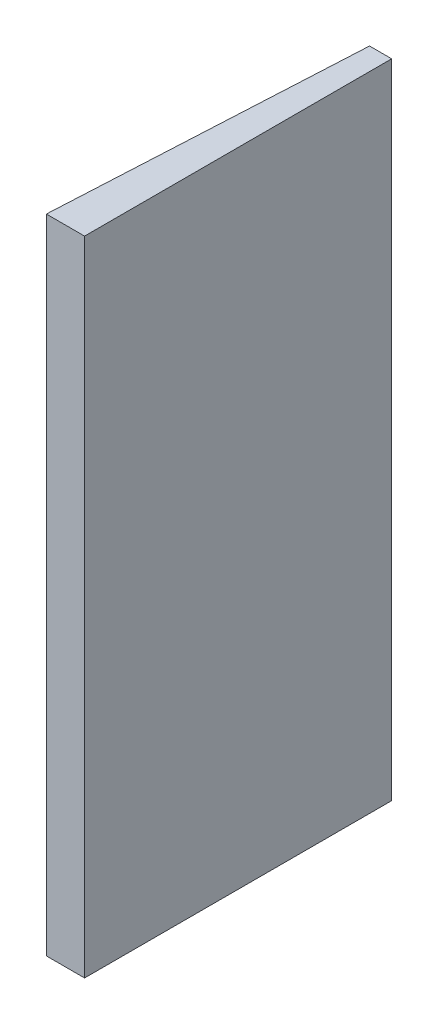
ISO-10303-21;
HEADER;
FILE_DESCRIPTION(('STEP AP214'),'2;1');
FILE_NAME('part.step','',(''),(''),'','','');
FILE_SCHEMA(('AUTOMOTIVE_DESIGN { 1 0 10303 214 1 1 1 1 }'));
ENDSEC;
DATA;
#1=APPLICATION_CONTEXT('core data for automotive mechanical design processes');
#2=APPLICATION_PROTOCOL_DEFINITION('international standard','automotive_design',2000,#1);
#3=PRODUCT_CONTEXT('',#1,'mechanical');
#4=PRODUCT('Part','Part','',(#3));
#5=PRODUCT_RELATED_PRODUCT_CATEGORY('part','',(#4));
#6=PRODUCT_DEFINITION_FORMATION('','',#4);
#7=PRODUCT_DEFINITION_CONTEXT('part definition',#1,'design');
#8=PRODUCT_DEFINITION('design','',#6,#7);
#9=PRODUCT_DEFINITION_SHAPE('','',#8);
#10=(LENGTH_UNIT() NAMED_UNIT(*) SI_UNIT(.MILLI.,.METRE.));
#11=(NAMED_UNIT(*) PLANE_ANGLE_UNIT() SI_UNIT($,.RADIAN.));
#12=(NAMED_UNIT(*) SI_UNIT($,.STERADIAN.) SOLID_ANGLE_UNIT());
#13=UNCERTAINTY_MEASURE_WITH_UNIT(LENGTH_MEASURE(1.E-05),#10,'distance_accuracy_value','');
#14=(GEOMETRIC_REPRESENTATION_CONTEXT(3) GLOBAL_UNCERTAINTY_ASSIGNED_CONTEXT((#13)) GLOBAL_UNIT_ASSIGNED_CONTEXT((#10,
#11,#12)) REPRESENTATION_CONTEXT('',''));
#15=CARTESIAN_POINT('',(0.,0.,0.));
#16=DIRECTION('',(0.,0.,1.));
#17=DIRECTION('',(1.,0.,0.));
#18=AXIS2_PLACEMENT_3D('',#15,#16,#17);
#19=CARTESIAN_POINT('',(-2.89582766178603,42.,-20.0576731421159));
#20=DIRECTION('',(0.,0.,1.));
#21=DIRECTION('',(1.,0.,0.));
#22=AXIS2_PLACEMENT_3D('',#19,#20,#21);
#23=PLANE('',#22);
#24=DIRECTION('',(-1.,0.,0.));
#25=VECTOR('',#24,1.);
#26=CARTESIAN_POINT('',(-2.89582766178603,-42.,-20.0576731421159));
#27=LINE('',#26,#25);
#28=CARTESIAN_POINT('',(0.,-42.,-20.0576731421159));
#29=VERTEX_POINT('',#28);
#30=CARTESIAN_POINT('',(-2.89582766178603,-42.,-20.0576731421159));
#31=VERTEX_POINT('',#30);
#32=EDGE_CURVE('E106',#29,#31,#27,.T.);
#33=ORIENTED_EDGE('',*,*,#32,.T.);
#34=DIRECTION('',(0.,-1.,0.));
#35=VECTOR('',#34,1.);
#36=CARTESIAN_POINT('',(-2.89582766178603,42.,-20.0576731421159));
#37=LINE('',#36,#35);
#38=CARTESIAN_POINT('',(-2.89582766178603,42.,-20.0576731421159));
#39=VERTEX_POINT('',#38);
#40=EDGE_CURVE('E12',#39,#31,#37,.T.);
#41=ORIENTED_EDGE('',*,*,#40,.F.);
#42=DIRECTION('',(-1.,0.,0.));
#43=VECTOR('',#42,1.);
#44=CARTESIAN_POINT('',(-2.89582766178603,42.,-20.0576731421159));
#45=LINE('',#44,#43);
#46=CARTESIAN_POINT('',(0.,42.,-20.0576731421159));
#47=VERTEX_POINT('',#46);
#48=EDGE_CURVE('E94',#47,#39,#45,.T.);
#49=ORIENTED_EDGE('',*,*,#48,.F.);
#50=DIRECTION('',(0.,-1.,0.));
#51=VECTOR('',#50,1.);
#52=CARTESIAN_POINT('',(0.,42.,-20.0576731421159));
#53=LINE('',#52,#51);
#54=EDGE_CURVE('E102',#47,#29,#53,.T.);
#55=ORIENTED_EDGE('',*,*,#54,.T.);
#56=EDGE_LOOP('',(#33,#41,#49,#55));
#57=FACE_BOUND('',#56,.T.);
#58=ADVANCED_FACE('F43',(#57),#23,.F.);
#59=CARTESIAN_POINT('',(-4.99999999999999,42.,20.0923268578841));
#60=DIRECTION('',(0.998629534754574,0.,0.0523359562429404));
#61=DIRECTION('',(0.0523359562429404,0.,-0.998629534754574));
#62=AXIS2_PLACEMENT_3D('',#59,#60,#61);
#63=PLANE('',#62);
#64=CARTESIAN_POINT('',(-3.69421789173863,29.8956518577535,-4.82348003424252));
#65=DIRECTION('',(-0.998629534754574,0.,-0.0523359562429404));
#66=DIRECTION('',(-0.0523359562429404,0.,0.998629534754574));
#67=AXIS2_PLACEMENT_3D('',#64,#65,#66);
#68=CIRCLE('',#67,6.3);
#69=CARTESIAN_POINT('',(-4.02393441606916,29.8956518577535,1.4678860347113));
#70=VERTEX_POINT('',#69);
#71=EDGE_CURVE('E127',#70,#70,#68,.T.);
#72=ORIENTED_EDGE('',*,*,#71,.F.);
#73=EDGE_LOOP('',(#72));
#74=FACE_BOUND('',#73,.T.);
#75=CARTESIAN_POINT('',(-3.69421789173863,-29.8956518577535,-4.82348003424252));
#76=DIRECTION('',(-0.998629534754574,0.,-0.0523359562429404));
#77=DIRECTION('',(-0.0523359562429404,0.,0.998629534754574));
#78=AXIS2_PLACEMENT_3D('',#75,#76,#77);
#79=CIRCLE('',#78,6.3);
#80=CARTESIAN_POINT('',(-3.87402597815768,-24.6149036705919,-1.39253735972165));
#81=VERTEX_POINT('',#80);
#82=EDGE_CURVE('E109',#81,#81,#79,.T.);
#83=ORIENTED_EDGE('',*,*,#82,.F.);
#84=EDGE_LOOP('',(#83));
#85=FACE_BOUND('',#84,.T.);
#86=DIRECTION('',(-0.0523359562429404,0.,0.998629534754574));
#87=VECTOR('',#86,1.);
#88=CARTESIAN_POINT('',(-4.99999999999999,-42.,20.0923268578841));
#89=LINE('',#88,#87);
#90=CARTESIAN_POINT('',(-4.99999999999999,-42.,20.0923268578841));
#91=VERTEX_POINT('',#90);
#92=EDGE_CURVE('E98',#31,#91,#89,.T.);
#93=ORIENTED_EDGE('',*,*,#92,.T.);
#94=DIRECTION('',(0.,-1.,0.));
#95=VECTOR('',#94,1.);
#96=CARTESIAN_POINT('',(-4.99999999999999,42.,20.0923268578841));
#97=LINE('',#96,#95);
#98=CARTESIAN_POINT('',(-4.99999999999999,42.,20.0923268578841));
#99=VERTEX_POINT('',#98);
#100=EDGE_CURVE('E51',#99,#91,#97,.T.);
#101=ORIENTED_EDGE('',*,*,#100,.F.);
#102=DIRECTION('',(-0.0523359562429404,0.,0.998629534754574));
#103=VECTOR('',#102,1.);
#104=CARTESIAN_POINT('',(-4.99999999999999,42.,20.0923268578841));
#105=LINE('',#104,#103);
#106=EDGE_CURVE('E89',#39,#99,#105,.T.);
#107=ORIENTED_EDGE('',*,*,#106,.F.);
#108=ORIENTED_EDGE('',*,*,#40,.T.);
#109=EDGE_LOOP('',(#93,#101,#107,#108));
#110=FACE_BOUND('',#109,.T.);
#111=ADVANCED_FACE('F97',(#74,#85,#110),#63,.F.);
#112=CARTESIAN_POINT('',(0.,42.,20.0923268578841));
#113=DIRECTION('',(0.,0.,-1.));
#114=DIRECTION('',(-1.,0.,0.));
#115=AXIS2_PLACEMENT_3D('',#112,#113,#114);
#116=PLANE('',#115);
#117=DIRECTION('',(1.,0.,0.));
#118=VECTOR('',#117,1.);
#119=CARTESIAN_POINT('',(0.,-42.,20.0923268578841));
#120=LINE('',#119,#118);
#121=CARTESIAN_POINT('',(0.,-42.,20.0923268578841));
#122=VERTEX_POINT('',#121);
#123=EDGE_CURVE('E76',#91,#122,#120,.T.);
#124=ORIENTED_EDGE('',*,*,#123,.T.);
#125=DIRECTION('',(0.,-1.,0.));
#126=VECTOR('',#125,1.);
#127=CARTESIAN_POINT('',(0.,42.,20.0923268578841));
#128=LINE('',#127,#126);
#129=CARTESIAN_POINT('',(0.,42.,20.0923268578841));
#130=VERTEX_POINT('',#129);
#131=EDGE_CURVE('E99',#130,#122,#128,.T.);
#132=ORIENTED_EDGE('',*,*,#131,.F.);
#133=DIRECTION('',(1.,0.,0.));
#134=VECTOR('',#133,1.);
#135=CARTESIAN_POINT('',(0.,42.,20.0923268578841));
#136=LINE('',#135,#134);
#137=EDGE_CURVE('E92',#99,#130,#136,.T.);
#138=ORIENTED_EDGE('',*,*,#137,.F.);
#139=ORIENTED_EDGE('',*,*,#100,.T.);
#140=EDGE_LOOP('',(#124,#132,#138,#139));
#141=FACE_BOUND('',#140,.T.);
#142=ADVANCED_FACE('F100',(#141),#116,.F.);
#143=CARTESIAN_POINT('',(0.,42.,-20.0576731421159));
#144=DIRECTION('',(-1.,0.,0.));
#145=DIRECTION('',(0.,0.,1.));
#146=AXIS2_PLACEMENT_3D('',#143,#144,#145);
#147=PLANE('',#146);
#148=DIRECTION('',(0.,0.,-1.));
#149=VECTOR('',#148,1.);
#150=CARTESIAN_POINT('',(0.,-42.,-20.0576731421159));
#151=LINE('',#150,#149);
#152=EDGE_CURVE('E82',#122,#29,#151,.T.);
#153=ORIENTED_EDGE('',*,*,#152,.T.);
#154=ORIENTED_EDGE('',*,*,#54,.F.);
#155=DIRECTION('',(0.,0.,-1.));
#156=VECTOR('',#155,1.);
#157=CARTESIAN_POINT('',(0.,42.,-20.0576731421159));
#158=LINE('',#157,#156);
#159=EDGE_CURVE('E59',#130,#47,#158,.T.);
#160=ORIENTED_EDGE('',*,*,#159,.F.);
#161=ORIENTED_EDGE('',*,*,#131,.T.);
#162=EDGE_LOOP('',(#153,#154,#160,#161));
#163=FACE_BOUND('',#162,.T.);
#164=ADVANCED_FACE('F114',(#163),#147,.F.);
#165=CARTESIAN_POINT('',(0.,42.,0.));
#166=DIRECTION('',(0.,-1.,0.));
#167=DIRECTION('',(0.,0.,-1.));
#168=AXIS2_PLACEMENT_3D('',#165,#166,#167);
#169=PLANE('',#168);
#170=ORIENTED_EDGE('',*,*,#48,.T.);
#171=ORIENTED_EDGE('',*,*,#106,.T.);
#172=ORIENTED_EDGE('',*,*,#137,.T.);
#173=ORIENTED_EDGE('',*,*,#159,.T.);
#174=EDGE_LOOP('',(#170,#171,#172,#173));
#175=FACE_BOUND('',#174,.T.);
#176=ADVANCED_FACE('F90',(#175),#169,.F.);
#177=CARTESIAN_POINT('',(0.,-42.,0.));
#178=DIRECTION('',(0.,-1.,0.));
#179=DIRECTION('',(0.,0.,-1.));
#180=AXIS2_PLACEMENT_3D('',#177,#178,#179);
#181=PLANE('',#180);
#182=ORIENTED_EDGE('',*,*,#32,.F.);
#183=ORIENTED_EDGE('',*,*,#152,.F.);
#184=ORIENTED_EDGE('',*,*,#123,.F.);
#185=ORIENTED_EDGE('',*,*,#92,.F.);
#186=EDGE_LOOP('',(#182,#183,#184,#185));
#187=FACE_BOUND('',#186,.T.);
#188=ADVANCED_FACE('F117',(#187),#181,.T.);
#189=CARTESIAN_POINT('',(-6.69010649600236,-29.8956518577535,-4.98048790297134));
#190=DIRECTION('',(-0.998629534754574,0.,-0.0523359562429404));
#191=DIRECTION('',(-0.0523359562429404,0.,0.998629534754574));
#192=AXIS2_PLACEMENT_3D('',#189,#190,#191);
#193=PLANE('',#192);
#194=CARTESIAN_POINT('',(-6.69010649600236,-29.8956518577535,-4.98048790297134));
#195=DIRECTION('',(-0.998629534754574,0.,-0.0523359562429404));
#196=DIRECTION('',(-0.0523359562429404,0.,0.998629534754574));
#197=AXIS2_PLACEMENT_3D('',#194,#195,#196);
#198=CIRCLE('',#197,3.3);
#199=CARTESIAN_POINT('',(-6.74491919075224,-26.7662569049443,-3.93459938222608));
#200=VERTEX_POINT('',#199);
#201=EDGE_CURVE('E122',#200,#200,#198,.T.);
#202=ORIENTED_EDGE('',*,*,#201,.T.);
#203=EDGE_LOOP('',(#202));
#204=FACE_BOUND('',#203,.T.);
#205=ADVANCED_FACE('F133',(#204),#193,.T.);
#206=CARTESIAN_POINT('',(-6.74491919075224,-26.7662569049443,-3.93459938222608));
#207=CARTESIAN_POINT('',(-3.87402597815768,-24.6149036705919,-1.39253735972165));
#208=CARTESIAN_POINT('',(-7.07247894538644,-28.8609045882863,2.3156130693482));
#209=CARTESIAN_POINT('',(-4.42677199026422,-31.4862059005306,9.15448485088072));
#210=CARTESIAN_POINT('',(-6.96285355588668,-35.1196944939046,0.223836027857672));
#211=CARTESIAN_POINT('',(-4.06715581742613,-42.0477022748537,2.29259950183898));
#212=CARTESIAN_POINT('',(-6.63529380125248,-33.0250468105627,-6.02637642371661));
#213=CARTESIAN_POINT('',(-3.51440980531959,-35.176400044915,-8.25442270876339));
#214=CARTESIAN_POINT('',(-6.30773404661828,-30.9303991272207,-12.2765888752909));
#215=CARTESIAN_POINT('',(-2.96166379321304,-28.3050978149763,-18.8014449193658));
#216=CARTESIAN_POINT('',(-6.41735943611804,-24.6716092216023,-10.1848118338004));
#217=CARTESIAN_POINT('',(-3.32127996605113,-17.7436014406532,-11.939559570324));
#218=CARTESIAN_POINT('',(-6.74491919075224,-26.7662569049443,-3.93459938222608));
#219=CARTESIAN_POINT('',(-3.87402597815768,-24.6149036705919,-1.39253735972165));
#220=(BOUNDED_SURFACE() B_SPLINE_SURFACE(3,1,((#206,#207),(#208,#209),(#210,#211),(#212,#213),
(#214,#215),(#216,#217),(#218,#219)),.UNSPECIFIED.,.T.,.F.,.F.) B_SPLINE_SURFACE_WITH_KNOTS((4,
3,4),(2,2),(0.,0.5,1.),(0.,1.),
.UNSPECIFIED.) GEOMETRIC_REPRESENTATION_ITEM() RATIONAL_B_SPLINE_SURFACE(((1.,1.),
(0.333333333333333,0.333333333333333),(0.333333333333333,0.333333333333333),(1.,1.),
(0.333333333333333,0.333333333333333),(0.333333333333333,0.333333333333333),(1.,1.))) REPRESENTATION_ITEM('') SURFACE());
#221=CARTESIAN_POINT('',(-6.74491919075224,-26.7662569049443,-3.93459938222608));
#222=CARTESIAN_POINT('',(-6.71501405312104,-26.7438469754198,-3.90811956949166));
#223=CARTESIAN_POINT('',(-6.68510891548985,-26.7214370458953,-3.88163975675724));
#224=CARTESIAN_POINT('',(-6.62529864022746,-26.6766171868463,-3.82868013128839));
#225=CARTESIAN_POINT('',(-6.59539350259627,-26.6542072573218,-3.80220031855397));
#226=CARTESIAN_POINT('',(-6.53558322733389,-26.6093873982728,-3.74924069308513));
#227=CARTESIAN_POINT('',(-6.50567808970269,-26.5869774687483,-3.72276088035071));
#228=CARTESIAN_POINT('',(-6.44586781444031,-26.5421576096993,-3.66980125488187));
#229=CARTESIAN_POINT('',(-6.41596267680911,-26.5197476801748,-3.64332144214745));
#230=CARTESIAN_POINT('',(-6.35615240154673,-26.4749278211258,-3.5903618166786));
#231=CARTESIAN_POINT('',(-6.32624726391553,-26.4525178916013,-3.56388200394418));
#232=CARTESIAN_POINT('',(-6.26643698865314,-26.4076980325522,-3.51092237847534));
#233=CARTESIAN_POINT('',(-6.23653185102195,-26.3852881030277,-3.48444256574092));
#234=CARTESIAN_POINT('',(-6.17672157575957,-26.3404682439787,-3.43148294027208));
#235=CARTESIAN_POINT('',(-6.14681643812837,-26.3180583144542,-3.40500312753766));
#236=CARTESIAN_POINT('',(-6.08700616286598,-26.2732384554052,-3.35204350206881));
#237=CARTESIAN_POINT('',(-6.05710102523479,-26.2508285258807,-3.32556368933439));
#238=CARTESIAN_POINT('',(-5.9972907499724,-26.2060086668317,-3.27260406386555));
#239=CARTESIAN_POINT('',(-5.96738561234121,-26.1835987373072,-3.24612425113113));
#240=CARTESIAN_POINT('',(-5.90757533707882,-26.1387788782582,-3.19316462566229));
#241=CARTESIAN_POINT('',(-5.87767019944763,-26.1163689487337,-3.16668481292787));
#242=CARTESIAN_POINT('',(-5.81785992418525,-26.0715490896847,-3.11372518745902));
#243=CARTESIAN_POINT('',(-5.78795478655405,-26.0491391601602,-3.0872453747246));
#244=CARTESIAN_POINT('',(-5.72814451129166,-26.0043193011112,-3.03428574925576));
#245=CARTESIAN_POINT('',(-5.69823937366047,-25.9819093715867,-3.00780593652134));
#246=CARTESIAN_POINT('',(-5.63842909839809,-25.9370895125377,-2.9548463110525));
#247=CARTESIAN_POINT('',(-5.60852396076689,-25.9146795830132,-2.92836649831808));
#248=CARTESIAN_POINT('',(-5.5487136855045,-25.8698597239642,-2.87540687284923));
#249=CARTESIAN_POINT('',(-5.51880854787331,-25.8474497944397,-2.84892706011481));
#250=CARTESIAN_POINT('',(-5.45899827261093,-25.8026299353906,-2.79596743464597));
#251=CARTESIAN_POINT('',(-5.42909313497973,-25.7802200058661,-2.76948762191155));
#252=CARTESIAN_POINT('',(-5.36928285971734,-25.7354001468171,-2.71652799644271));
#253=CARTESIAN_POINT('',(-5.33937772208615,-25.7129902172926,-2.69004818370829));
#254=CARTESIAN_POINT('',(-5.27956744682376,-25.6681703582436,-2.63708855823944));
#255=CARTESIAN_POINT('',(-5.24966230919257,-25.6457604287191,-2.61060874550502));
#256=CARTESIAN_POINT('',(-5.18985203393019,-25.6009405696701,-2.55764912003618));
#257=CARTESIAN_POINT('',(-5.15994689629899,-25.5785306401456,-2.53116930730176));
#258=CARTESIAN_POINT('',(-5.1001366210366,-25.5337107810966,-2.47820968183292));
#259=CARTESIAN_POINT('',(-5.07023148340541,-25.5113008515721,-2.4517298690985));
#260=CARTESIAN_POINT('',(-5.01042120814302,-25.4664809925231,-2.39877024362965));
#261=CARTESIAN_POINT('',(-4.98051607051183,-25.4440710629986,-2.37229043089523));
#262=CARTESIAN_POINT('',(-4.92070579524944,-25.3992512039496,-2.31933080542639));
#263=CARTESIAN_POINT('',(-4.89080065761825,-25.3768412744251,-2.29285099269197));
#264=CARTESIAN_POINT('',(-4.83099038235586,-25.3320214153761,-2.23989136722313));
#265=CARTESIAN_POINT('',(-4.80108524472467,-25.3096114858516,-2.21341155448871));
#266=CARTESIAN_POINT('',(-4.74127496946229,-25.2647916268026,-2.16045192901986));
#267=CARTESIAN_POINT('',(-4.71136983183109,-25.242381697278,-2.13397211628544));
#268=CARTESIAN_POINT('',(-4.6515595565687,-25.197561838229,-2.0810124908166));
#269=CARTESIAN_POINT('',(-4.62165441893751,-25.1751519087045,-2.05453267808218));
#270=CARTESIAN_POINT('',(-4.56184414367512,-25.1303320496555,-2.00157305261334));
#271=CARTESIAN_POINT('',(-4.53193900604393,-25.107922120131,-1.97509323987892));
#272=CARTESIAN_POINT('',(-4.47212873078155,-25.063102261082,-1.92213361441007));
#273=CARTESIAN_POINT('',(-4.44222359315035,-25.0406923315575,-1.89565380167565));
#274=CARTESIAN_POINT('',(-4.38241331788796,-24.9958724725085,-1.84269417620681));
#275=CARTESIAN_POINT('',(-4.35250818025677,-24.973462542984,-1.81621436347239));
#276=CARTESIAN_POINT('',(-4.29269790499438,-24.928642683935,-1.76325473800355));
#277=CARTESIAN_POINT('',(-4.26279276736319,-24.9062327544105,-1.73677492526913));
#278=CARTESIAN_POINT('',(-4.2029824921008,-24.8614128953615,-1.68381529980028));
#279=CARTESIAN_POINT('',(-4.17307735446961,-24.839002965837,-1.65733548706586));
#280=CARTESIAN_POINT('',(-4.11326707920722,-24.794183106788,-1.60437586159702));
#281=CARTESIAN_POINT('',(-4.08336194157603,-24.7717731772635,-1.5778960488626));
#282=CARTESIAN_POINT('',(-4.02355166631365,-24.7269533182145,-1.52493642339376));
#283=CARTESIAN_POINT('',(-3.99364652868245,-24.70454338869,-1.49845661065934));
#284=CARTESIAN_POINT('',(-3.93383625342006,-24.6597235296409,-1.44549698519049));
#285=CARTESIAN_POINT('',(-3.90393111578887,-24.6373136001164,-1.41901717245607));
#286=CARTESIAN_POINT('',(-3.87402597815768,-24.6149036705919,-1.39253735972165));
#287=B_SPLINE_CURVE_WITH_KNOTS('',3,(#221,#222,#223,#224,#225,#226,#227,#228,#229,#230,#231,
#232,#233,#234,#235,#236,#237,#238,#239,#240,#241,#242,#243,#244,#245,#246,#247,#248,#249,#250,
#251,#252,#253,#254,#255,#256,#257,#258,#259,#260,#261,#262,#263,#264,#265,#266,#267,#268,#269,
#270,#271,#272,#273,#274,#275,#276,#277,#278,#279,#280,#281,#282,#283,#284,#285,#286),
.UNSPECIFIED.,.F.,.F.,(4,2,2,2,2,2,2,2,2,2,2,2,2,2,2,2,2,2,2,2,2,2,2,2,2,2,2,2,2,2,2,2,4),(0.,
0.137402052838939,0.274804105677879,0.412206158516819,0.549608211355758,0.687010264194696,
0.824412317033636,0.961814369872576,1.09921642271151,1.23661847555045,1.3740205283894,
1.51142258122833,1.64882463406727,1.78622668690621,1.92362873974515,2.06103079258409,
2.19843284542303,2.33583489826197,2.47323695110091,2.61063900393985,2.74804105677879,
2.88544310961773,3.02284516245666,3.16024721529561,3.29764926813454,3.43505132097348,
3.57245337381242,3.70985542665136,3.8472574794903,3.98465953232924,4.12206158516818,
4.25946363800712,4.39686569084606),.UNSPECIFIED.);
#288=EDGE_CURVE('BSEAM143',#200,#81,#287,.T.);
#289=ORIENTED_EDGE('',*,*,#201,.F.);
#290=ORIENTED_EDGE('',*,*,#82,.T.);
#291=ORIENTED_EDGE('',*,*,#288,.T.);
#292=ORIENTED_EDGE('',*,*,#288,.F.);
#293=EDGE_LOOP('',(#289,#291,#290,#292));
#294=FACE_BOUND('',#293,.T.);
#295=ADVANCED_FACE('F143',(#294),#220,.T.);
#296=CARTESIAN_POINT('',(-6.69010649600236,29.8956518577535,-4.98048790297134));
#297=DIRECTION('',(-0.998629534754574,0.,-0.0523359562429404));
#298=DIRECTION('',(-0.0523359562429404,0.,0.998629534754574));
#299=AXIS2_PLACEMENT_3D('',#296,#297,#298);
#300=PLANE('',#299);
#301=CARTESIAN_POINT('',(-6.69010649600236,29.8956518577535,-4.98048790297134));
#302=DIRECTION('',(-0.998629534754574,0.,-0.0523359562429404));
#303=DIRECTION('',(-0.0523359562429404,0.,0.998629534754574));
#304=AXIS2_PLACEMENT_3D('',#301,#302,#303);
#305=CIRCLE('',#304,3.3);
#306=CARTESIAN_POINT('',(-6.86281515160406,29.8956518577535,-1.68501043828124));
#307=VERTEX_POINT('',#306);
#308=EDGE_CURVE('E173',#307,#307,#305,.T.);
#309=ORIENTED_EDGE('',*,*,#308,.T.);
#310=EDGE_LOOP('',(#309));
#311=FACE_BOUND('',#310,.T.);
#312=ADVANCED_FACE('F153',(#311),#300,.T.);
#313=CARTESIAN_POINT('',(-6.69010649600236,29.8956518577535,-4.98048790297134));
#314=DIRECTION('',(0.998629534754574,0.,0.0523359562429404));
#315=DIRECTION('',(0.0523359562429404,0.,-0.998629534754574));
#316=AXIS2_PLACEMENT_3D('',#313,#314,#315);
#317=CONICAL_SURFACE('',#316,3.3,0.785398163397448);
#318=ORIENTED_EDGE('',*,*,#308,.F.);
#319=EDGE_LOOP('',(#318));
#320=FACE_BOUND('',#319,.T.);
#321=ORIENTED_EDGE('',*,*,#71,.T.);
#322=EDGE_LOOP('',(#321));
#323=FACE_BOUND('',#322,.T.);
#324=ADVANCED_FACE('F145',(#320,#323),#317,.T.);
#325=CLOSED_SHELL('',(#58,#111,#142,#164,#176,#188,#205,#295,#312,#324));
#326=MANIFOLD_SOLID_BREP('B2',#325);
#327=ADVANCED_BREP_SHAPE_REPRESENTATION('',(#18,#326),#14);
#328=SHAPE_DEFINITION_REPRESENTATION(#9,#327);
ENDSEC;
END-ISO-10303-21;
